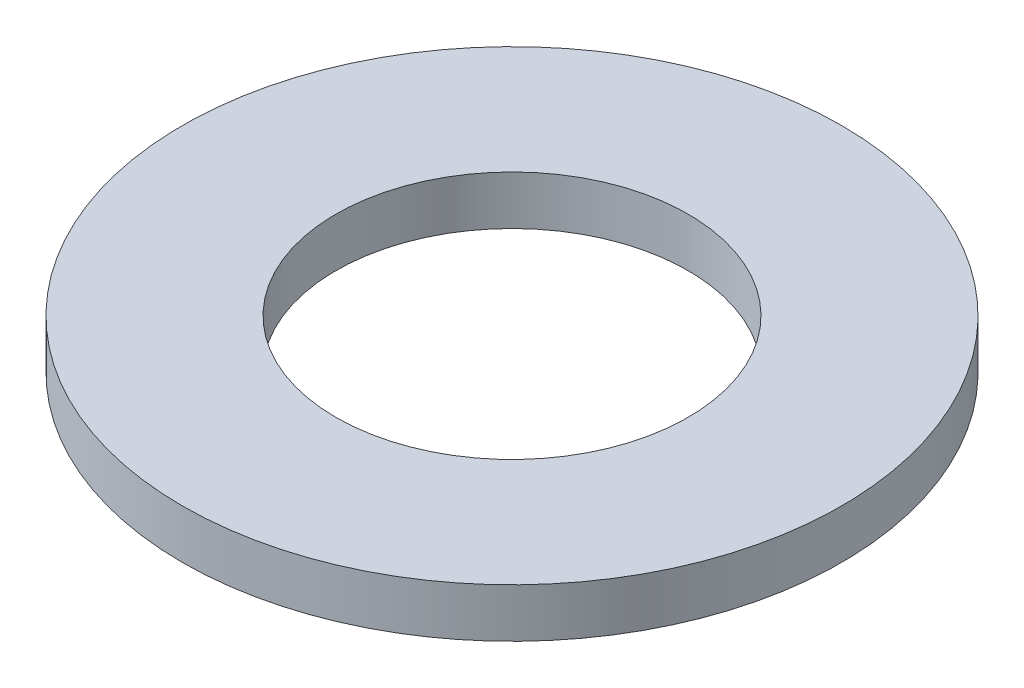
ISO-10303-21;
HEADER;
FILE_DESCRIPTION(('STEP AP214'),'2;1');
FILE_NAME('part.step','',(''),(''),'','','');
FILE_SCHEMA(('AUTOMOTIVE_DESIGN { 1 0 10303 214 1 1 1 1 }'));
ENDSEC;
DATA;
#1=APPLICATION_CONTEXT('core data for automotive mechanical design processes');
#2=APPLICATION_PROTOCOL_DEFINITION('international standard','automotive_design',2000,#1);
#3=PRODUCT_CONTEXT('',#1,'mechanical');
#4=PRODUCT('Part','Part','',(#3));
#5=PRODUCT_RELATED_PRODUCT_CATEGORY('part','',(#4));
#6=PRODUCT_DEFINITION_FORMATION('','',#4);
#7=PRODUCT_DEFINITION_CONTEXT('part definition',#1,'design');
#8=PRODUCT_DEFINITION('design','',#6,#7);
#9=PRODUCT_DEFINITION_SHAPE('','',#8);
#10=(LENGTH_UNIT() NAMED_UNIT(*) SI_UNIT(.MILLI.,.METRE.));
#11=(NAMED_UNIT(*) PLANE_ANGLE_UNIT() SI_UNIT($,.RADIAN.));
#12=(NAMED_UNIT(*) SI_UNIT($,.STERADIAN.) SOLID_ANGLE_UNIT());
#13=UNCERTAINTY_MEASURE_WITH_UNIT(LENGTH_MEASURE(1.E-05),#10,'distance_accuracy_value','');
#14=(GEOMETRIC_REPRESENTATION_CONTEXT(3) GLOBAL_UNCERTAINTY_ASSIGNED_CONTEXT((#13)) GLOBAL_UNIT_ASSIGNED_CONTEXT((#10,
#11,#12)) REPRESENTATION_CONTEXT('',''));
#15=CARTESIAN_POINT('',(0.,0.,0.));
#16=DIRECTION('',(0.,0.,1.));
#17=DIRECTION('',(1.,0.,0.));
#18=AXIS2_PLACEMENT_3D('',#15,#16,#17);
#19=CARTESIAN_POINT('',(0.,3.302,0.));
#20=DIRECTION('',(0.,-1.,0.));
#21=DIRECTION('',(0.,0.,-1.));
#22=AXIS2_PLACEMENT_3D('',#19,#20,#21);
#23=CYLINDRICAL_SURFACE('',#22,22.225);
#24=CARTESIAN_POINT('',(0.,3.302,0.));
#25=DIRECTION('',(0.,1.,0.));
#26=DIRECTION('',(0.,0.,1.));
#27=AXIS2_PLACEMENT_3D('',#24,#25,#26);
#28=CIRCLE('',#27,22.225);
#29=CARTESIAN_POINT('',(0.,3.302,22.225));
#30=VERTEX_POINT('',#29);
#31=EDGE_CURVE('E10',#30,#30,#28,.T.);
#32=ORIENTED_EDGE('',*,*,#31,.F.);
#33=EDGE_LOOP('',(#32));
#34=FACE_BOUND('',#33,.T.);
#35=CARTESIAN_POINT('',(0.,0.,0.));
#36=DIRECTION('',(0.,1.,0.));
#37=DIRECTION('',(0.,0.,1.));
#38=AXIS2_PLACEMENT_3D('',#35,#36,#37);
#39=CIRCLE('',#38,22.225);
#40=CARTESIAN_POINT('',(0.,0.,22.225));
#41=VERTEX_POINT('',#40);
#42=EDGE_CURVE('E40',#41,#41,#39,.T.);
#43=ORIENTED_EDGE('',*,*,#42,.T.);
#44=EDGE_LOOP('',(#43));
#45=FACE_BOUND('',#44,.T.);
#46=ADVANCED_FACE('F37',(#34,#45),#23,.T.);
#47=CARTESIAN_POINT('',(0.,3.302,0.));
#48=DIRECTION('',(0.,1.,0.));
#49=DIRECTION('',(0.,0.,1.));
#50=AXIS2_PLACEMENT_3D('',#47,#48,#49);
#51=PLANE('',#50);
#52=CARTESIAN_POINT('',(0.,3.302,0.));
#53=DIRECTION('',(0.,1.,0.));
#54=DIRECTION('',(0.,0.,1.));
#55=AXIS2_PLACEMENT_3D('',#52,#53,#54);
#56=CIRCLE('',#55,11.8745);
#57=CARTESIAN_POINT('',(0.,3.302,11.8745));
#58=VERTEX_POINT('',#57);
#59=EDGE_CURVE('E51',#58,#58,#56,.T.);
#60=ORIENTED_EDGE('',*,*,#59,.F.);
#61=EDGE_LOOP('',(#60));
#62=FACE_BOUND('',#61,.T.);
#63=ORIENTED_EDGE('',*,*,#31,.T.);
#64=EDGE_LOOP('',(#63));
#65=FACE_BOUND('',#64,.T.);
#66=ADVANCED_FACE('F68',(#62,#65),#51,.T.);
#67=CARTESIAN_POINT('',(0.,0.,0.));
#68=DIRECTION('',(0.,1.,0.));
#69=DIRECTION('',(0.,0.,1.));
#70=AXIS2_PLACEMENT_3D('',#67,#68,#69);
#71=PLANE('',#70);
#72=CARTESIAN_POINT('',(0.,0.,0.));
#73=DIRECTION('',(0.,1.,0.));
#74=DIRECTION('',(0.,0.,1.));
#75=AXIS2_PLACEMENT_3D('',#72,#73,#74);
#76=CIRCLE('',#75,11.8745);
#77=CARTESIAN_POINT('',(0.,0.,11.8745));
#78=VERTEX_POINT('',#77);
#79=EDGE_CURVE('E49',#78,#78,#76,.T.);
#80=ORIENTED_EDGE('',*,*,#79,.T.);
#81=EDGE_LOOP('',(#80));
#82=FACE_BOUND('',#81,.T.);
#83=ORIENTED_EDGE('',*,*,#42,.F.);
#84=EDGE_LOOP('',(#83));
#85=FACE_BOUND('',#84,.T.);
#86=ADVANCED_FACE('F59',(#82,#85),#71,.F.);
#87=CARTESIAN_POINT('',(0.,0.,0.));
#88=DIRECTION('',(0.,1.,0.));
#89=DIRECTION('',(0.,0.,1.));
#90=AXIS2_PLACEMENT_3D('',#87,#88,#89);
#91=CYLINDRICAL_SURFACE('',#90,11.8745);
#92=ORIENTED_EDGE('',*,*,#79,.F.);
#93=EDGE_LOOP('',(#92));
#94=FACE_BOUND('',#93,.T.);
#95=ORIENTED_EDGE('',*,*,#59,.T.);
#96=EDGE_LOOP('',(#95));
#97=FACE_BOUND('',#96,.T.);
#98=ADVANCED_FACE('F62',(#94,#97),#91,.F.);
#99=CLOSED_SHELL('',(#46,#66,#86,#98));
#100=MANIFOLD_SOLID_BREP('B2',#99);
#101=ADVANCED_BREP_SHAPE_REPRESENTATION('',(#18,#100),#14);
#102=SHAPE_DEFINITION_REPRESENTATION(#9,#101);
ENDSEC;
END-ISO-10303-21;
